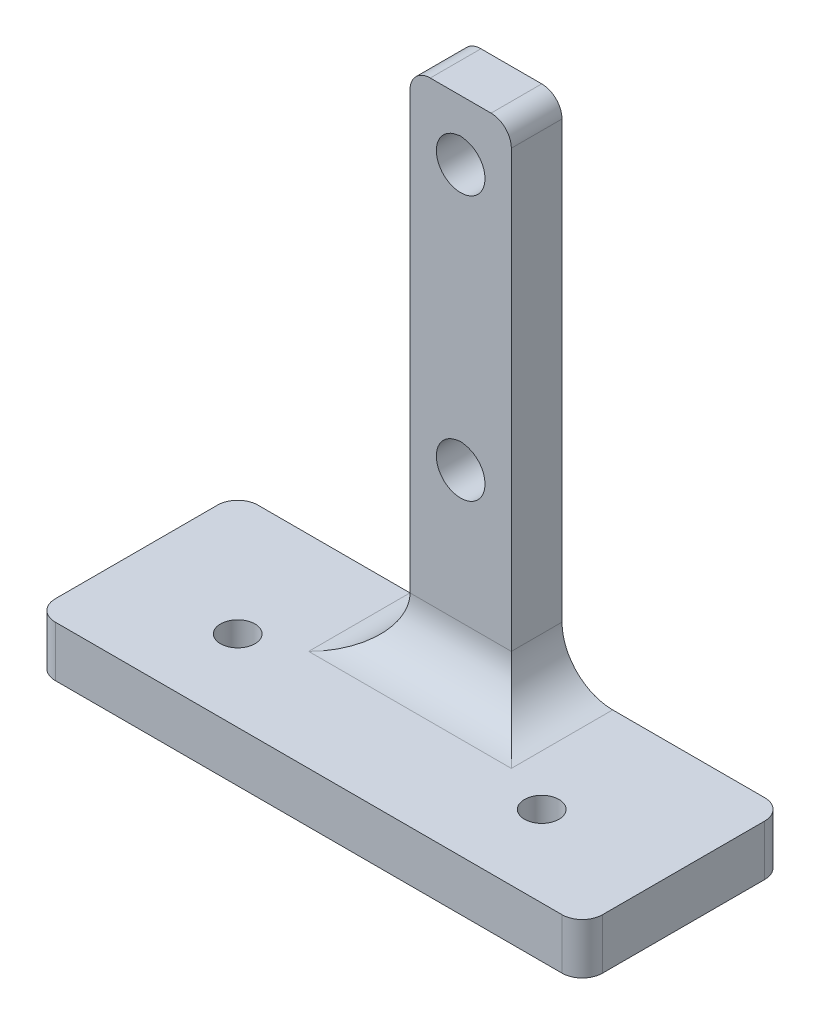
ISO-10303-21;
HEADER;
FILE_DESCRIPTION(('STEP AP214'),'2;1');
FILE_NAME('part.step','',(''),(''),'','','');
FILE_SCHEMA(('AUTOMOTIVE_DESIGN { 1 0 10303 214 1 1 1 1 }'));
ENDSEC;
DATA;
#1=APPLICATION_CONTEXT('core data for automotive mechanical design processes');
#2=APPLICATION_PROTOCOL_DEFINITION('international standard','automotive_design',2000,#1);
#3=PRODUCT_CONTEXT('',#1,'mechanical');
#4=PRODUCT('Part','Part','',(#3));
#5=PRODUCT_RELATED_PRODUCT_CATEGORY('part','',(#4));
#6=PRODUCT_DEFINITION_FORMATION('','',#4);
#7=PRODUCT_DEFINITION_CONTEXT('part definition',#1,'design');
#8=PRODUCT_DEFINITION('design','',#6,#7);
#9=PRODUCT_DEFINITION_SHAPE('','',#8);
#10=(LENGTH_UNIT() NAMED_UNIT(*) SI_UNIT(.MILLI.,.METRE.));
#11=(NAMED_UNIT(*) PLANE_ANGLE_UNIT() SI_UNIT($,.RADIAN.));
#12=(NAMED_UNIT(*) SI_UNIT($,.STERADIAN.) SOLID_ANGLE_UNIT());
#13=UNCERTAINTY_MEASURE_WITH_UNIT(LENGTH_MEASURE(1.E-05),#10,'distance_accuracy_value','');
#14=(GEOMETRIC_REPRESENTATION_CONTEXT(3) GLOBAL_UNCERTAINTY_ASSIGNED_CONTEXT((#13)) GLOBAL_UNIT_ASSIGNED_CONTEXT((#10,
#11,#12)) REPRESENTATION_CONTEXT('',''));
#15=CARTESIAN_POINT('',(0.,0.,0.));
#16=DIRECTION('',(0.,0.,1.));
#17=DIRECTION('',(1.,0.,0.));
#18=AXIS2_PLACEMENT_3D('',#15,#16,#17);
#19=CARTESIAN_POINT('',(-27.,5.,10.));
#20=DIRECTION('',(1.,0.,0.));
#21=DIRECTION('',(0.,0.,-1.));
#22=AXIS2_PLACEMENT_3D('',#19,#20,#21);
#23=PLANE('',#22);
#24=DIRECTION('',(0.,0.,1.));
#25=VECTOR('',#24,1.);
#26=CARTESIAN_POINT('',(-27.,5.,10.));
#27=LINE('',#26,#25);
#28=CARTESIAN_POINT('',(-27.,5.,-8.));
#29=VERTEX_POINT('',#28);
#30=CARTESIAN_POINT('',(-27.,5.,8.));
#31=VERTEX_POINT('',#30);
#32=EDGE_CURVE('E272',#29,#31,#27,.T.);
#33=ORIENTED_EDGE('',*,*,#32,.F.);
#34=DIRECTION('',(0.,-1.,0.));
#35=VECTOR('',#34,1.);
#36=CARTESIAN_POINT('',(-27.,5.,-8.));
#37=LINE('',#36,#35);
#38=CARTESIAN_POINT('',(-27.,0.,-8.));
#39=VERTEX_POINT('',#38);
#40=EDGE_CURVE('E389',#29,#39,#37,.T.);
#41=ORIENTED_EDGE('',*,*,#40,.T.);
#42=DIRECTION('',(0.,0.,1.));
#43=VECTOR('',#42,1.);
#44=CARTESIAN_POINT('',(-27.,0.,10.));
#45=LINE('',#44,#43);
#46=CARTESIAN_POINT('',(-27.,0.,8.));
#47=VERTEX_POINT('',#46);
#48=EDGE_CURVE('E271',#39,#47,#45,.T.);
#49=ORIENTED_EDGE('',*,*,#48,.T.);
#50=DIRECTION('',(0.,-1.,0.));
#51=VECTOR('',#50,1.);
#52=CARTESIAN_POINT('',(-27.,5.,8.));
#53=LINE('',#52,#51);
#54=EDGE_CURVE('E295',#47,#31,#53,.F.);
#55=ORIENTED_EDGE('',*,*,#54,.T.);
#56=EDGE_LOOP('',(#33,#41,#49,#55));
#57=FACE_BOUND('',#56,.T.);
#58=ADVANCED_FACE('F35',(#57),#23,.F.);
#59=CARTESIAN_POINT('',(27.,5.,10.));
#60=DIRECTION('',(0.,0.,-1.));
#61=DIRECTION('',(-1.,0.,0.));
#62=AXIS2_PLACEMENT_3D('',#59,#60,#61);
#63=PLANE('',#62);
#64=DIRECTION('',(1.,0.,0.));
#65=VECTOR('',#64,1.);
#66=CARTESIAN_POINT('',(27.,0.,10.));
#67=LINE('',#66,#65);
#68=CARTESIAN_POINT('',(-25.,0.,10.));
#69=VERTEX_POINT('',#68);
#70=CARTESIAN_POINT('',(25.,0.,10.));
#71=VERTEX_POINT('',#70);
#72=EDGE_CURVE('E411',#69,#71,#67,.T.);
#73=ORIENTED_EDGE('',*,*,#72,.T.);
#74=DIRECTION('',(0.,-1.,0.));
#75=VECTOR('',#74,1.);
#76=CARTESIAN_POINT('',(25.,5.,10.));
#77=LINE('',#76,#75);
#78=CARTESIAN_POINT('',(25.,5.,10.));
#79=VERTEX_POINT('',#78);
#80=EDGE_CURVE('E325',#71,#79,#77,.F.);
#81=ORIENTED_EDGE('',*,*,#80,.T.);
#82=DIRECTION('',(1.,0.,0.));
#83=VECTOR('',#82,1.);
#84=CARTESIAN_POINT('',(27.,5.,10.));
#85=LINE('',#84,#83);
#86=CARTESIAN_POINT('',(-25.,5.,10.));
#87=VERTEX_POINT('',#86);
#88=EDGE_CURVE('E275',#87,#79,#85,.T.);
#89=ORIENTED_EDGE('',*,*,#88,.F.);
#90=DIRECTION('',(0.,-1.,0.));
#91=VECTOR('',#90,1.);
#92=CARTESIAN_POINT('',(-25.,5.,10.));
#93=LINE('',#92,#91);
#94=EDGE_CURVE('E322',#87,#69,#93,.T.);
#95=ORIENTED_EDGE('',*,*,#94,.T.);
#96=EDGE_LOOP('',(#73,#81,#89,#95));
#97=FACE_BOUND('',#96,.T.);
#98=ADVANCED_FACE('F416',(#97),#63,.F.);
#99=CARTESIAN_POINT('',(27.,5.,10.));
#100=DIRECTION('',(-1.,0.,0.));
#101=DIRECTION('',(0.,0.,1.));
#102=AXIS2_PLACEMENT_3D('',#99,#100,#101);
#103=PLANE('',#102);
#104=DIRECTION('',(0.,0.,-1.));
#105=VECTOR('',#104,1.);
#106=CARTESIAN_POINT('',(27.,0.,10.));
#107=LINE('',#106,#105);
#108=CARTESIAN_POINT('',(27.,0.,8.));
#109=VERTEX_POINT('',#108);
#110=CARTESIAN_POINT('',(27.,0.,-8.00000000000001));
#111=VERTEX_POINT('',#110);
#112=EDGE_CURVE('E383',#109,#111,#107,.T.);
#113=ORIENTED_EDGE('',*,*,#112,.T.);
#114=DIRECTION('',(0.,-1.,0.));
#115=VECTOR('',#114,1.);
#116=CARTESIAN_POINT('',(27.,5.,-8.00000000000001));
#117=LINE('',#116,#115);
#118=CARTESIAN_POINT('',(27.,5.,-8.00000000000001));
#119=VERTEX_POINT('',#118);
#120=EDGE_CURVE('E320',#111,#119,#117,.F.);
#121=ORIENTED_EDGE('',*,*,#120,.T.);
#122=DIRECTION('',(0.,0.,-1.));
#123=VECTOR('',#122,1.);
#124=CARTESIAN_POINT('',(27.,5.,10.));
#125=LINE('',#124,#123);
#126=CARTESIAN_POINT('',(27.,5.,8.));
#127=VERTEX_POINT('',#126);
#128=EDGE_CURVE('E279',#127,#119,#125,.T.);
#129=ORIENTED_EDGE('',*,*,#128,.F.);
#130=DIRECTION('',(0.,-1.,0.));
#131=VECTOR('',#130,1.);
#132=CARTESIAN_POINT('',(27.,5.,8.));
#133=LINE('',#132,#131);
#134=EDGE_CURVE('E317',#127,#109,#133,.T.);
#135=ORIENTED_EDGE('',*,*,#134,.T.);
#136=EDGE_LOOP('',(#113,#121,#129,#135));
#137=FACE_BOUND('',#136,.T.);
#138=ADVANCED_FACE('F371',(#137),#103,.F.);
#139=CARTESIAN_POINT('',(27.,5.,-10.));
#140=DIRECTION('',(0.,0.,1.));
#141=DIRECTION('',(1.,0.,0.));
#142=AXIS2_PLACEMENT_3D('',#139,#140,#141);
#143=PLANE('',#142);
#144=CARTESIAN_POINT('',(0.,23.,-10.));
#145=DIRECTION('',(0.,0.,1.));
#146=DIRECTION('',(1.,0.,0.));
#147=AXIS2_PLACEMENT_3D('',#144,#145,#146);
#148=CIRCLE('',#147,2.4);
#149=CARTESIAN_POINT('',(-0.41675562640062,25.3635386072293,-10.));
#150=VERTEX_POINT('',#149);
#151=CARTESIAN_POINT('',(0.416755626400634,25.3635386072293,-10.));
#152=VERTEX_POINT('',#151);
#153=EDGE_CURVE('E196',#150,#152,#148,.T.);
#154=ORIENTED_EDGE('',*,*,#153,.T.);
#155=DIRECTION('',(-0.984807753012205,0.173648177666949,0.));
#156=VECTOR('',#155,1.);
#157=CARTESIAN_POINT('',(29.6807872969416,20.2035002594053,-10.));
#158=LINE('',#157,#156);
#159=CARTESIAN_POINT('',(0.,25.4370238685258,-10.));
#160=VERTEX_POINT('',#159);
#161=EDGE_CURVE('E220',#152,#160,#158,.T.);
#162=ORIENTED_EDGE('',*,*,#161,.T.);
#163=DIRECTION('',(-0.984807753012208,-0.17364817766693,0.));
#164=VECTOR('',#163,1.);
#165=CARTESIAN_POINT('',(22.6909134642781,29.438044129199,-10.));
#166=LINE('',#165,#164);
#167=EDGE_CURVE('E216',#160,#150,#166,.T.);
#168=ORIENTED_EDGE('',*,*,#167,.T.);
#169=EDGE_LOOP('',(#154,#162,#168));
#170=FACE_BOUND('',#169,.T.);
#171=DIRECTION('',(0.984807753012209,-0.173648177666923,0.));
#172=VECTOR('',#171,1.);
#173=CARTESIAN_POINT('',(34.1442925150605,45.5172962546951,-10.));
#174=LINE('',#173,#172);
#175=CARTESIAN_POINT('',(0.,51.5378562623021,-10.));
#176=VERTEX_POINT('',#175);
#177=CARTESIAN_POINT('',(0.416755626400632,51.4643710010056,-10.));
#178=VERTEX_POINT('',#177);
#179=EDGE_CURVE('E241',#176,#178,#174,.T.);
#180=ORIENTED_EDGE('',*,*,#179,.F.);
#181=DIRECTION('',(-0.984807753012211,-0.173648177666916,0.));
#182=VECTOR('',#181,1.);
#183=CARTESIAN_POINT('',(18.2274082461596,54.7518401244877,-10.));
#184=LINE('',#183,#182);
#185=CARTESIAN_POINT('',(-0.416755626400618,51.4643710010056,-10.));
#186=VERTEX_POINT('',#185);
#187=EDGE_CURVE('E244',#176,#186,#184,.T.);
#188=ORIENTED_EDGE('',*,*,#187,.T.);
#189=CARTESIAN_POINT('',(0.,49.1008323937763,-10.));
#190=DIRECTION('',(0.,0.,1.));
#191=DIRECTION('',(1.,0.,0.));
#192=AXIS2_PLACEMENT_3D('',#189,#190,#191);
#193=CIRCLE('',#192,2.4);
#194=EDGE_CURVE('E234',#186,#178,#193,.T.);
#195=ORIENTED_EDGE('',*,*,#194,.T.);
#196=EDGE_LOOP('',(#180,#188,#195));
#197=FACE_BOUND('',#196,.T.);
#198=DIRECTION('',(-1.,0.,0.));
#199=VECTOR('',#198,1.);
#200=CARTESIAN_POINT('',(27.,0.,-10.));
#201=LINE('',#200,#199);
#202=CARTESIAN_POINT('',(25.,0.,-10.));
#203=VERTEX_POINT('',#202);
#204=CARTESIAN_POINT('',(-25.,0.,-10.));
#205=VERTEX_POINT('',#204);
#206=EDGE_CURVE('E276',#203,#205,#201,.T.);
#207=ORIENTED_EDGE('',*,*,#206,.T.);
#208=DIRECTION('',(0.,-1.,0.));
#209=VECTOR('',#208,1.);
#210=CARTESIAN_POINT('',(-25.,5.,-10.));
#211=LINE('',#210,#209);
#212=CARTESIAN_POINT('',(-25.,5.,-10.));
#213=VERTEX_POINT('',#212);
#214=EDGE_CURVE('E306',#205,#213,#211,.F.);
#215=ORIENTED_EDGE('',*,*,#214,.T.);
#216=DIRECTION('',(-1.,0.,0.));
#217=VECTOR('',#216,1.);
#218=CARTESIAN_POINT('',(27.,5.,-10.));
#219=LINE('',#218,#217);
#220=CARTESIAN_POINT('',(-9.99999999999999,5.,-10.));
#221=VERTEX_POINT('',#220);
#222=EDGE_CURVE('E282',#221,#213,#219,.T.);
#223=ORIENTED_EDGE('',*,*,#222,.F.);
#224=CARTESIAN_POINT('',(-10.,10.,-10.));
#225=DIRECTION('',(0.,0.,1.));
#226=DIRECTION('',(1.,0.,0.));
#227=AXIS2_PLACEMENT_3D('',#224,#225,#226);
#228=CIRCLE('',#227,5.);
#229=CARTESIAN_POINT('',(-5.,10.,-10.));
#230=VERTEX_POINT('',#229);
#231=EDGE_CURVE('E44',#221,#230,#228,.T.);
#232=ORIENTED_EDGE('',*,*,#231,.T.);
#233=DIRECTION('',(0.,-1.,0.));
#234=VECTOR('',#233,1.);
#235=CARTESIAN_POINT('',(-5.,55.,-10.));
#236=LINE('',#235,#234);
#237=CARTESIAN_POINT('',(-5.,53.,-10.));
#238=VERTEX_POINT('',#237);
#239=EDGE_CURVE('E265',#238,#230,#236,.T.);
#240=ORIENTED_EDGE('',*,*,#239,.F.);
#241=CARTESIAN_POINT('',(-3.,53.,-10.));
#242=DIRECTION('',(0.,0.,1.));
#243=DIRECTION('',(1.,0.,0.));
#244=AXIS2_PLACEMENT_3D('',#241,#242,#243);
#245=CIRCLE('',#244,2.);
#246=CARTESIAN_POINT('',(-3.,55.,-10.));
#247=VERTEX_POINT('',#246);
#248=EDGE_CURVE('E298',#238,#247,#245,.F.);
#249=ORIENTED_EDGE('',*,*,#248,.T.);
#250=DIRECTION('',(-1.,0.,0.));
#251=VECTOR('',#250,1.);
#252=CARTESIAN_POINT('',(-5.,55.,-10.));
#253=LINE('',#252,#251);
#254=CARTESIAN_POINT('',(3.,55.,-10.));
#255=VERTEX_POINT('',#254);
#256=EDGE_CURVE('E262',#255,#247,#253,.T.);
#257=ORIENTED_EDGE('',*,*,#256,.F.);
#258=CARTESIAN_POINT('',(3.,53.,-10.));
#259=DIRECTION('',(0.,0.,1.));
#260=DIRECTION('',(1.,0.,0.));
#261=AXIS2_PLACEMENT_3D('',#258,#259,#260);
#262=CIRCLE('',#261,2.);
#263=CARTESIAN_POINT('',(5.,53.,-10.));
#264=VERTEX_POINT('',#263);
#265=EDGE_CURVE('E300',#255,#264,#262,.F.);
#266=ORIENTED_EDGE('',*,*,#265,.T.);
#267=DIRECTION('',(0.,-1.,0.));
#268=VECTOR('',#267,1.);
#269=CARTESIAN_POINT('',(5.,55.,-10.));
#270=LINE('',#269,#268);
#271=CARTESIAN_POINT('',(5.,10.,-10.));
#272=VERTEX_POINT('',#271);
#273=EDGE_CURVE('E269',#264,#272,#270,.T.);
#274=ORIENTED_EDGE('',*,*,#273,.T.);
#275=CARTESIAN_POINT('',(10.,10.,-10.));
#276=DIRECTION('',(0.,0.,1.));
#277=DIRECTION('',(1.,0.,0.));
#278=AXIS2_PLACEMENT_3D('',#275,#276,#277);
#279=CIRCLE('',#278,5.);
#280=CARTESIAN_POINT('',(10.,5.,-10.));
#281=VERTEX_POINT('',#280);
#282=EDGE_CURVE('E11',#272,#281,#279,.T.);
#283=ORIENTED_EDGE('',*,*,#282,.T.);
#284=CARTESIAN_POINT('',(25.,5.,-10.));
#285=VERTEX_POINT('',#284);
#286=EDGE_CURVE('E291',#285,#281,#219,.T.);
#287=ORIENTED_EDGE('',*,*,#286,.F.);
#288=DIRECTION('',(0.,-1.,0.));
#289=VECTOR('',#288,1.);
#290=CARTESIAN_POINT('',(25.,5.,-10.));
#291=LINE('',#290,#289);
#292=EDGE_CURVE('E303',#285,#203,#291,.T.);
#293=ORIENTED_EDGE('',*,*,#292,.T.);
#294=EDGE_LOOP('',(#207,#215,#223,#232,#240,#249,#257,#266,#274,#283,#287,#293));
#295=FACE_BOUND('',#294,.T.);
#296=ADVANCED_FACE('F367',(#170,#197,#295),#143,.F.);
#297=CARTESIAN_POINT('',(0.,5.,0.));
#298=DIRECTION('',(0.,1.,0.));
#299=DIRECTION('',(0.,0.,1.));
#300=AXIS2_PLACEMENT_3D('',#297,#298,#299);
#301=PLANE('',#300);
#302=CARTESIAN_POINT('',(15.,5.,2.));
#303=DIRECTION('',(0.,1.,0.));
#304=DIRECTION('',(0.,0.,1.));
#305=AXIS2_PLACEMENT_3D('',#302,#303,#304);
#306=CIRCLE('',#305,1.69999999999999);
#307=CARTESIAN_POINT('',(15.,5.,3.69999999999999));
#308=VERTEX_POINT('',#307);
#309=EDGE_CURVE('E247',#308,#308,#306,.T.);
#310=ORIENTED_EDGE('',*,*,#309,.F.);
#311=EDGE_LOOP('',(#310));
#312=FACE_BOUND('',#311,.T.);
#313=CARTESIAN_POINT('',(-15.,5.,2.));
#314=DIRECTION('',(0.,1.,0.));
#315=DIRECTION('',(0.,0.,1.));
#316=AXIS2_PLACEMENT_3D('',#313,#314,#315);
#317=CIRCLE('',#316,1.69999999999999);
#318=CARTESIAN_POINT('',(-15.,5.,3.69999999999999));
#319=VERTEX_POINT('',#318);
#320=EDGE_CURVE('E253',#319,#319,#317,.T.);
#321=ORIENTED_EDGE('',*,*,#320,.F.);
#322=EDGE_LOOP('',(#321));
#323=FACE_BOUND('',#322,.T.);
#324=DIRECTION('',(1.,0.,0.));
#325=VECTOR('',#324,1.);
#326=CARTESIAN_POINT('',(0.,5.,0.));
#327=LINE('',#326,#325);
#328=CARTESIAN_POINT('',(10.,5.,0.));
#329=VERTEX_POINT('',#328);
#330=CARTESIAN_POINT('',(-10.,5.,0.));
#331=VERTEX_POINT('',#330);
#332=EDGE_CURVE('E347',#329,#331,#327,.F.);
#333=ORIENTED_EDGE('',*,*,#332,.T.);
#334=DIRECTION('',(0.,0.,1.));
#335=VECTOR('',#334,1.);
#336=CARTESIAN_POINT('',(-10.,5.,0.));
#337=LINE('',#336,#335);
#338=EDGE_CURVE('E351',#331,#221,#337,.F.);
#339=ORIENTED_EDGE('',*,*,#338,.T.);
#340=ORIENTED_EDGE('',*,*,#222,.T.);
#341=CARTESIAN_POINT('',(-25.,5.,-8.));
#342=DIRECTION('',(0.,1.,0.));
#343=DIRECTION('',(0.,0.,1.));
#344=AXIS2_PLACEMENT_3D('',#341,#342,#343);
#345=CIRCLE('',#344,2.);
#346=EDGE_CURVE('E315',#213,#29,#345,.T.);
#347=ORIENTED_EDGE('',*,*,#346,.T.);
#348=ORIENTED_EDGE('',*,*,#32,.T.);
#349=CARTESIAN_POINT('',(-25.,5.,8.));
#350=DIRECTION('',(0.,1.,0.));
#351=DIRECTION('',(0.,0.,1.));
#352=AXIS2_PLACEMENT_3D('',#349,#350,#351);
#353=CIRCLE('',#352,2.);
#354=EDGE_CURVE('E309',#31,#87,#353,.T.);
#355=ORIENTED_EDGE('',*,*,#354,.T.);
#356=ORIENTED_EDGE('',*,*,#88,.T.);
#357=CARTESIAN_POINT('',(25.,5.,8.));
#358=DIRECTION('',(0.,1.,0.));
#359=DIRECTION('',(0.,0.,1.));
#360=AXIS2_PLACEMENT_3D('',#357,#358,#359);
#361=CIRCLE('',#360,2.);
#362=EDGE_CURVE('E311',#79,#127,#361,.T.);
#363=ORIENTED_EDGE('',*,*,#362,.T.);
#364=ORIENTED_EDGE('',*,*,#128,.T.);
#365=CARTESIAN_POINT('',(25.,5.,-8.));
#366=DIRECTION('',(0.,1.,0.));
#367=DIRECTION('',(0.,0.,1.));
#368=AXIS2_PLACEMENT_3D('',#365,#366,#367);
#369=CIRCLE('',#368,2.);
#370=EDGE_CURVE('E313',#119,#285,#369,.T.);
#371=ORIENTED_EDGE('',*,*,#370,.T.);
#372=ORIENTED_EDGE('',*,*,#286,.T.);
#373=DIRECTION('',(0.,0.,-1.));
#374=VECTOR('',#373,1.);
#375=CARTESIAN_POINT('',(10.,5.,0.));
#376=LINE('',#375,#374);
#377=EDGE_CURVE('E342',#281,#329,#376,.F.);
#378=ORIENTED_EDGE('',*,*,#377,.T.);
#379=EDGE_LOOP('',(#333,#339,#340,#347,#348,#355,#356,#363,#364,#371,#372,#378));
#380=FACE_BOUND('',#379,.T.);
#381=ADVANCED_FACE('F370',(#312,#323,#380),#301,.T.);
#382=CARTESIAN_POINT('',(0.,0.,0.));
#383=DIRECTION('',(0.,1.,0.));
#384=DIRECTION('',(0.,0.,1.));
#385=AXIS2_PLACEMENT_3D('',#382,#383,#384);
#386=PLANE('',#385);
#387=CARTESIAN_POINT('',(15.,0.,2.));
#388=DIRECTION('',(0.,1.,0.));
#389=DIRECTION('',(0.,0.,1.));
#390=AXIS2_PLACEMENT_3D('',#387,#388,#389);
#391=CIRCLE('',#390,1.7);
#392=CARTESIAN_POINT('',(15.,0.,3.7));
#393=VERTEX_POINT('',#392);
#394=EDGE_CURVE('E250',#393,#393,#391,.T.);
#395=ORIENTED_EDGE('',*,*,#394,.T.);
#396=EDGE_LOOP('',(#395));
#397=FACE_BOUND('',#396,.T.);
#398=CARTESIAN_POINT('',(-15.,0.,2.));
#399=DIRECTION('',(0.,1.,0.));
#400=DIRECTION('',(0.,0.,1.));
#401=AXIS2_PLACEMENT_3D('',#398,#399,#400);
#402=CIRCLE('',#401,1.7);
#403=CARTESIAN_POINT('',(-15.,0.,3.7));
#404=VERTEX_POINT('',#403);
#405=EDGE_CURVE('E256',#404,#404,#402,.T.);
#406=ORIENTED_EDGE('',*,*,#405,.T.);
#407=EDGE_LOOP('',(#406));
#408=FACE_BOUND('',#407,.T.);
#409=ORIENTED_EDGE('',*,*,#48,.F.);
#410=CARTESIAN_POINT('',(-25.,0.,-8.));
#411=DIRECTION('',(0.,1.,0.));
#412=DIRECTION('',(0.,0.,1.));
#413=AXIS2_PLACEMENT_3D('',#410,#411,#412);
#414=CIRCLE('',#413,2.);
#415=EDGE_CURVE('E301',#39,#205,#414,.F.);
#416=ORIENTED_EDGE('',*,*,#415,.T.);
#417=ORIENTED_EDGE('',*,*,#206,.F.);
#418=CARTESIAN_POINT('',(25.,0.,-8.));
#419=DIRECTION('',(0.,1.,0.));
#420=DIRECTION('',(0.,0.,1.));
#421=AXIS2_PLACEMENT_3D('',#418,#419,#420);
#422=CIRCLE('',#421,2.);
#423=EDGE_CURVE('E406',#203,#111,#422,.F.);
#424=ORIENTED_EDGE('',*,*,#423,.T.);
#425=ORIENTED_EDGE('',*,*,#112,.F.);
#426=CARTESIAN_POINT('',(25.,0.,8.));
#427=DIRECTION('',(0.,1.,0.));
#428=DIRECTION('',(0.,0.,1.));
#429=AXIS2_PLACEMENT_3D('',#426,#427,#428);
#430=CIRCLE('',#429,2.);
#431=EDGE_CURVE('E404',#109,#71,#430,.F.);
#432=ORIENTED_EDGE('',*,*,#431,.T.);
#433=ORIENTED_EDGE('',*,*,#72,.F.);
#434=CARTESIAN_POINT('',(-25.,0.,8.));
#435=DIRECTION('',(0.,1.,0.));
#436=DIRECTION('',(0.,0.,1.));
#437=AXIS2_PLACEMENT_3D('',#434,#435,#436);
#438=CIRCLE('',#437,2.);
#439=EDGE_CURVE('E398',#69,#47,#438,.F.);
#440=ORIENTED_EDGE('',*,*,#439,.T.);
#441=EDGE_LOOP('',(#409,#416,#417,#424,#425,#432,#433,#440));
#442=FACE_BOUND('',#441,.T.);
#443=ADVANCED_FACE('F459',(#397,#408,#442),#386,.F.);
#444=CARTESIAN_POINT('',(-5.,55.,-10.));
#445=DIRECTION('',(1.,0.,0.));
#446=DIRECTION('',(0.,0.,-1.));
#447=AXIS2_PLACEMENT_3D('',#444,#445,#446);
#448=PLANE('',#447);
#449=ORIENTED_EDGE('',*,*,#239,.T.);
#450=DIRECTION('',(0.,0.,1.));
#451=VECTOR('',#450,1.);
#452=CARTESIAN_POINT('',(-5.,10.,-10.));
#453=LINE('',#452,#451);
#454=CARTESIAN_POINT('',(-5.,10.,-5.));
#455=VERTEX_POINT('',#454);
#456=EDGE_CURVE('E340',#230,#455,#453,.T.);
#457=ORIENTED_EDGE('',*,*,#456,.T.);
#458=DIRECTION('',(0.,-1.,0.));
#459=VECTOR('',#458,1.);
#460=CARTESIAN_POINT('',(-5.,55.,-5.));
#461=LINE('',#460,#459);
#462=CARTESIAN_POINT('',(-5.,53.,-5.));
#463=VERTEX_POINT('',#462);
#464=EDGE_CURVE('E268',#463,#455,#461,.T.);
#465=ORIENTED_EDGE('',*,*,#464,.F.);
#466=DIRECTION('',(0.,0.,1.));
#467=VECTOR('',#466,1.);
#468=CARTESIAN_POINT('',(-5.,53.,-10.));
#469=LINE('',#468,#467);
#470=EDGE_CURVE('E339',#463,#238,#469,.F.);
#471=ORIENTED_EDGE('',*,*,#470,.T.);
#472=EDGE_LOOP('',(#449,#457,#465,#471));
#473=FACE_BOUND('',#472,.T.);
#474=ADVANCED_FACE('F437',(#473),#448,.F.);
#475=CARTESIAN_POINT('',(-5.,55.,-5.));
#476=DIRECTION('',(0.,0.,-1.));
#477=DIRECTION('',(-1.,0.,0.));
#478=AXIS2_PLACEMENT_3D('',#475,#476,#477);
#479=PLANE('',#478);
#480=DIRECTION('',(-0.984807753012208,-0.17364817766693,0.));
#481=VECTOR('',#480,1.);
#482=CARTESIAN_POINT('',(0.,25.4370238685258,-5.));
#483=LINE('',#482,#481);
#484=CARTESIAN_POINT('',(0.,25.4370238685258,-5.));
#485=VERTEX_POINT('',#484);
#486=CARTESIAN_POINT('',(-0.416755626400618,25.3635386072293,-5.));
#487=VERTEX_POINT('',#486);
#488=EDGE_CURVE('E204',#485,#487,#483,.T.);
#489=ORIENTED_EDGE('',*,*,#488,.F.);
#490=DIRECTION('',(-0.984807753012205,0.173648177666949,0.));
#491=VECTOR('',#490,1.);
#492=CARTESIAN_POINT('',(0.,25.4370238685258,-5.));
#493=LINE('',#492,#491);
#494=CARTESIAN_POINT('',(0.416755626400634,25.3635386072293,-5.));
#495=VERTEX_POINT('',#494);
#496=EDGE_CURVE('E208',#495,#485,#493,.T.);
#497=ORIENTED_EDGE('',*,*,#496,.F.);
#498=CARTESIAN_POINT('',(0.,23.,-5.));
#499=DIRECTION('',(0.,0.,1.));
#500=DIRECTION('',(1.,0.,0.));
#501=AXIS2_PLACEMENT_3D('',#498,#499,#500);
#502=CIRCLE('',#501,2.4);
#503=EDGE_CURVE('E193',#487,#495,#502,.T.);
#504=ORIENTED_EDGE('',*,*,#503,.F.);
#505=EDGE_LOOP('',(#489,#497,#504));
#506=FACE_BOUND('',#505,.T.);
#507=CARTESIAN_POINT('',(0.,49.1008323937763,-5.));
#508=DIRECTION('',(0.,0.,1.));
#509=DIRECTION('',(1.,0.,0.));
#510=AXIS2_PLACEMENT_3D('',#507,#508,#509);
#511=CIRCLE('',#510,2.4);
#512=CARTESIAN_POINT('',(-0.416755626400618,51.4643710010056,-5.));
#513=VERTEX_POINT('',#512);
#514=CARTESIAN_POINT('',(0.416755626400632,51.4643710010056,-5.));
#515=VERTEX_POINT('',#514);
#516=EDGE_CURVE('E225',#513,#515,#511,.T.);
#517=ORIENTED_EDGE('',*,*,#516,.F.);
#518=DIRECTION('',(-0.98480775301221,-0.173648177666916,0.));
#519=VECTOR('',#518,1.);
#520=CARTESIAN_POINT('',(0.,51.5378562623021,-5.));
#521=LINE('',#520,#519);
#522=CARTESIAN_POINT('',(0.,51.5378562623021,-5.));
#523=VERTEX_POINT('',#522);
#524=EDGE_CURVE('E223',#523,#513,#521,.T.);
#525=ORIENTED_EDGE('',*,*,#524,.F.);
#526=DIRECTION('',(0.984807753012209,-0.173648177666923,0.));
#527=VECTOR('',#526,1.);
#528=CARTESIAN_POINT('',(0.,51.5378562623021,-5.));
#529=LINE('',#528,#527);
#530=EDGE_CURVE('E228',#523,#515,#529,.T.);
#531=ORIENTED_EDGE('',*,*,#530,.T.);
#532=EDGE_LOOP('',(#517,#525,#531));
#533=FACE_BOUND('',#532,.T.);
#534=ORIENTED_EDGE('',*,*,#464,.T.);
#535=DIRECTION('',(1.,0.,0.));
#536=VECTOR('',#535,1.);
#537=CARTESIAN_POINT('',(-5.,10.,-5.));
#538=LINE('',#537,#536);
#539=CARTESIAN_POINT('',(5.,10.,-5.));
#540=VERTEX_POINT('',#539);
#541=EDGE_CURVE('E60',#455,#540,#538,.T.);
#542=ORIENTED_EDGE('',*,*,#541,.T.);
#543=DIRECTION('',(0.,-1.,0.));
#544=VECTOR('',#543,1.);
#545=CARTESIAN_POINT('',(5.,55.,-5.));
#546=LINE('',#545,#544);
#547=CARTESIAN_POINT('',(5.,53.,-5.));
#548=VERTEX_POINT('',#547);
#549=EDGE_CURVE('E266',#548,#540,#546,.T.);
#550=ORIENTED_EDGE('',*,*,#549,.F.);
#551=CARTESIAN_POINT('',(3.,53.,-5.));
#552=DIRECTION('',(0.,0.,-1.));
#553=DIRECTION('',(-1.,0.,0.));
#554=AXIS2_PLACEMENT_3D('',#551,#552,#553);
#555=CIRCLE('',#554,2.);
#556=CARTESIAN_POINT('',(3.,55.,-5.));
#557=VERTEX_POINT('',#556);
#558=EDGE_CURVE('E337',#548,#557,#555,.F.);
#559=ORIENTED_EDGE('',*,*,#558,.T.);
#560=DIRECTION('',(1.,0.,0.));
#561=VECTOR('',#560,1.);
#562=CARTESIAN_POINT('',(-5.,55.,-5.));
#563=LINE('',#562,#561);
#564=CARTESIAN_POINT('',(-3.,55.,-5.));
#565=VERTEX_POINT('',#564);
#566=EDGE_CURVE('E259',#565,#557,#563,.T.);
#567=ORIENTED_EDGE('',*,*,#566,.F.);
#568=CARTESIAN_POINT('',(-3.,53.,-5.));
#569=DIRECTION('',(0.,0.,-1.));
#570=DIRECTION('',(-1.,0.,0.));
#571=AXIS2_PLACEMENT_3D('',#568,#569,#570);
#572=CIRCLE('',#571,2.);
#573=EDGE_CURVE('E335',#565,#463,#572,.F.);
#574=ORIENTED_EDGE('',*,*,#573,.T.);
#575=EDGE_LOOP('',(#534,#542,#550,#559,#567,#574));
#576=FACE_BOUND('',#575,.T.);
#577=ADVANCED_FACE('F210',(#506,#533,#576),#479,.F.);
#578=CARTESIAN_POINT('',(5.,55.,-10.));
#579=DIRECTION('',(-1.,0.,0.));
#580=DIRECTION('',(0.,0.,1.));
#581=AXIS2_PLACEMENT_3D('',#578,#579,#580);
#582=PLANE('',#581);
#583=ORIENTED_EDGE('',*,*,#549,.T.);
#584=DIRECTION('',(0.,0.,-1.));
#585=VECTOR('',#584,1.);
#586=CARTESIAN_POINT('',(5.,10.,-10.));
#587=LINE('',#586,#585);
#588=EDGE_CURVE('E52',#540,#272,#587,.T.);
#589=ORIENTED_EDGE('',*,*,#588,.T.);
#590=ORIENTED_EDGE('',*,*,#273,.F.);
#591=DIRECTION('',(0.,0.,-1.));
#592=VECTOR('',#591,1.);
#593=CARTESIAN_POINT('',(5.,53.,-5.));
#594=LINE('',#593,#592);
#595=EDGE_CURVE('E333',#264,#548,#594,.F.);
#596=ORIENTED_EDGE('',*,*,#595,.T.);
#597=EDGE_LOOP('',(#583,#589,#590,#596));
#598=FACE_BOUND('',#597,.T.);
#599=ADVANCED_FACE('F451',(#598),#582,.F.);
#600=CARTESIAN_POINT('',(0.,55.,0.));
#601=DIRECTION('',(0.,1.,0.));
#602=DIRECTION('',(0.,0.,1.));
#603=AXIS2_PLACEMENT_3D('',#600,#601,#602);
#604=PLANE('',#603);
#605=ORIENTED_EDGE('',*,*,#566,.T.);
#606=DIRECTION('',(0.,0.,-1.));
#607=VECTOR('',#606,1.);
#608=CARTESIAN_POINT('',(3.,55.,-10.));
#609=LINE('',#608,#607);
#610=EDGE_CURVE('E330',#557,#255,#609,.T.);
#611=ORIENTED_EDGE('',*,*,#610,.T.);
#612=ORIENTED_EDGE('',*,*,#256,.T.);
#613=DIRECTION('',(0.,0.,1.));
#614=VECTOR('',#613,1.);
#615=CARTESIAN_POINT('',(-3.,55.,-5.));
#616=LINE('',#615,#614);
#617=EDGE_CURVE('E327',#247,#565,#616,.T.);
#618=ORIENTED_EDGE('',*,*,#617,.T.);
#619=EDGE_LOOP('',(#605,#611,#612,#618));
#620=FACE_BOUND('',#619,.T.);
#621=ADVANCED_FACE('F444',(#620),#604,.T.);
#622=CARTESIAN_POINT('',(-15.,5.,2.));
#623=DIRECTION('',(0.,1.,0.));
#624=DIRECTION('',(0.,0.,1.));
#625=AXIS2_PLACEMENT_3D('',#622,#623,#624);
#626=CYLINDRICAL_SURFACE('',#625,1.69999999999999);
#627=ORIENTED_EDGE('',*,*,#405,.F.);
#628=EDGE_LOOP('',(#627));
#629=FACE_BOUND('',#628,.T.);
#630=ORIENTED_EDGE('',*,*,#320,.T.);
#631=EDGE_LOOP('',(#630));
#632=FACE_BOUND('',#631,.T.);
#633=ADVANCED_FACE('F513',(#629,#632),#626,.F.);
#634=CARTESIAN_POINT('',(15.,5.,2.));
#635=DIRECTION('',(0.,1.,0.));
#636=DIRECTION('',(0.,0.,1.));
#637=AXIS2_PLACEMENT_3D('',#634,#635,#636);
#638=CYLINDRICAL_SURFACE('',#637,1.69999999999999);
#639=ORIENTED_EDGE('',*,*,#394,.F.);
#640=EDGE_LOOP('',(#639));
#641=FACE_BOUND('',#640,.T.);
#642=ORIENTED_EDGE('',*,*,#309,.T.);
#643=EDGE_LOOP('',(#642));
#644=FACE_BOUND('',#643,.T.);
#645=ADVANCED_FACE('F471',(#641,#644),#638,.F.);
#646=CARTESIAN_POINT('',(-25.,5.,-8.));
#647=DIRECTION('',(0.,-1.,0.));
#648=DIRECTION('',(0.,0.,-1.));
#649=AXIS2_PLACEMENT_3D('',#646,#647,#648);
#650=CYLINDRICAL_SURFACE('',#649,2.);
#651=ORIENTED_EDGE('',*,*,#346,.F.);
#652=ORIENTED_EDGE('',*,*,#214,.F.);
#653=ORIENTED_EDGE('',*,*,#415,.F.);
#654=ORIENTED_EDGE('',*,*,#40,.F.);
#655=EDGE_LOOP('',(#651,#652,#653,#654));
#656=FACE_BOUND('',#655,.T.);
#657=ADVANCED_FACE('F386',(#656),#650,.T.);
#658=CARTESIAN_POINT('',(25.,5.,-8.));
#659=DIRECTION('',(0.,-1.,0.));
#660=DIRECTION('',(0.,0.,-1.));
#661=AXIS2_PLACEMENT_3D('',#658,#659,#660);
#662=CYLINDRICAL_SURFACE('',#661,2.);
#663=ORIENTED_EDGE('',*,*,#370,.F.);
#664=ORIENTED_EDGE('',*,*,#120,.F.);
#665=ORIENTED_EDGE('',*,*,#423,.F.);
#666=ORIENTED_EDGE('',*,*,#292,.F.);
#667=EDGE_LOOP('',(#663,#664,#665,#666));
#668=FACE_BOUND('',#667,.T.);
#669=ADVANCED_FACE('F429',(#668),#662,.T.);
#670=CARTESIAN_POINT('',(25.,5.,8.));
#671=DIRECTION('',(0.,-1.,0.));
#672=DIRECTION('',(0.,0.,-1.));
#673=AXIS2_PLACEMENT_3D('',#670,#671,#672);
#674=CYLINDRICAL_SURFACE('',#673,2.);
#675=ORIENTED_EDGE('',*,*,#362,.F.);
#676=ORIENTED_EDGE('',*,*,#80,.F.);
#677=ORIENTED_EDGE('',*,*,#431,.F.);
#678=ORIENTED_EDGE('',*,*,#134,.F.);
#679=EDGE_LOOP('',(#675,#676,#677,#678));
#680=FACE_BOUND('',#679,.T.);
#681=ADVANCED_FACE('F421',(#680),#674,.T.);
#682=CARTESIAN_POINT('',(-25.,5.,8.));
#683=DIRECTION('',(0.,-1.,0.));
#684=DIRECTION('',(0.,0.,-1.));
#685=AXIS2_PLACEMENT_3D('',#682,#683,#684);
#686=CYLINDRICAL_SURFACE('',#685,2.);
#687=ORIENTED_EDGE('',*,*,#354,.F.);
#688=ORIENTED_EDGE('',*,*,#54,.F.);
#689=ORIENTED_EDGE('',*,*,#439,.F.);
#690=ORIENTED_EDGE('',*,*,#94,.F.);
#691=EDGE_LOOP('',(#687,#688,#689,#690));
#692=FACE_BOUND('',#691,.T.);
#693=ADVANCED_FACE('F476',(#692),#686,.T.);
#694=CARTESIAN_POINT('',(3.,53.,0.));
#695=DIRECTION('',(0.,0.,1.));
#696=DIRECTION('',(1.,0.,0.));
#697=AXIS2_PLACEMENT_3D('',#694,#695,#696);
#698=CYLINDRICAL_SURFACE('',#697,2.);
#699=ORIENTED_EDGE('',*,*,#558,.F.);
#700=ORIENTED_EDGE('',*,*,#595,.F.);
#701=ORIENTED_EDGE('',*,*,#265,.F.);
#702=ORIENTED_EDGE('',*,*,#610,.F.);
#703=EDGE_LOOP('',(#699,#700,#701,#702));
#704=FACE_BOUND('',#703,.T.);
#705=ADVANCED_FACE('F449',(#704),#698,.T.);
#706=CARTESIAN_POINT('',(-3.,53.,0.));
#707=DIRECTION('',(0.,0.,-1.));
#708=DIRECTION('',(-1.,0.,0.));
#709=AXIS2_PLACEMENT_3D('',#706,#707,#708);
#710=CYLINDRICAL_SURFACE('',#709,2.);
#711=ORIENTED_EDGE('',*,*,#248,.F.);
#712=ORIENTED_EDGE('',*,*,#470,.F.);
#713=ORIENTED_EDGE('',*,*,#573,.F.);
#714=ORIENTED_EDGE('',*,*,#617,.F.);
#715=EDGE_LOOP('',(#711,#712,#713,#714));
#716=FACE_BOUND('',#715,.T.);
#717=ADVANCED_FACE('F440',(#716),#710,.T.);
#718=CARTESIAN_POINT('',(0.,51.5378562623021,-18.));
#719=DIRECTION('',(-0.173648177666916,0.984807753012211,0.));
#720=DIRECTION('',(-0.984807753012211,-0.173648177666916,0.));
#721=AXIS2_PLACEMENT_3D('',#718,#719,#720);
#722=PLANE('',#721);
#723=DIRECTION('',(0.,0.,1.));
#724=VECTOR('',#723,1.);
#725=CARTESIAN_POINT('',(0.,51.5378562623021,-18.));
#726=LINE('',#725,#724);
#727=EDGE_CURVE('E232',#176,#523,#726,.T.);
#728=ORIENTED_EDGE('',*,*,#727,.T.);
#729=ORIENTED_EDGE('',*,*,#524,.T.);
#730=DIRECTION('',(0.,0.,1.));
#731=VECTOR('',#730,1.);
#732=CARTESIAN_POINT('',(-0.416755626400618,51.4643710010056,-18.));
#733=LINE('',#732,#731);
#734=EDGE_CURVE('E231',#186,#513,#733,.T.);
#735=ORIENTED_EDGE('',*,*,#734,.F.);
#736=ORIENTED_EDGE('',*,*,#187,.F.);
#737=EDGE_LOOP('',(#728,#729,#735,#736));
#738=FACE_BOUND('',#737,.T.);
#739=ADVANCED_FACE('F483',(#738),#722,.F.);
#740=CARTESIAN_POINT('',(0.,51.5378562623021,-18.));
#741=DIRECTION('',(-0.173648177666923,-0.984807753012209,0.));
#742=DIRECTION('',(0.984807753012209,-0.173648177666923,0.));
#743=AXIS2_PLACEMENT_3D('',#740,#741,#742);
#744=PLANE('',#743);
#745=ORIENTED_EDGE('',*,*,#179,.T.);
#746=DIRECTION('',(0.,0.,1.));
#747=VECTOR('',#746,1.);
#748=CARTESIAN_POINT('',(0.416755626400632,51.4643710010056,-18.));
#749=LINE('',#748,#747);
#750=EDGE_CURVE('E235',#178,#515,#749,.T.);
#751=ORIENTED_EDGE('',*,*,#750,.T.);
#752=ORIENTED_EDGE('',*,*,#530,.F.);
#753=ORIENTED_EDGE('',*,*,#727,.F.);
#754=EDGE_LOOP('',(#745,#751,#752,#753));
#755=FACE_BOUND('',#754,.T.);
#756=ADVANCED_FACE('F501',(#755),#744,.T.);
#757=CARTESIAN_POINT('',(0.,49.1008323937763,-18.));
#758=DIRECTION('',(0.,0.,1.));
#759=DIRECTION('',(1.,0.,0.));
#760=AXIS2_PLACEMENT_3D('',#757,#758,#759);
#761=CYLINDRICAL_SURFACE('',#760,2.4);
#762=ORIENTED_EDGE('',*,*,#734,.T.);
#763=ORIENTED_EDGE('',*,*,#516,.T.);
#764=ORIENTED_EDGE('',*,*,#750,.F.);
#765=ORIENTED_EDGE('',*,*,#194,.F.);
#766=EDGE_LOOP('',(#762,#763,#764,#765));
#767=FACE_BOUND('',#766,.T.);
#768=ADVANCED_FACE('F500',(#767),#761,.F.);
#769=CARTESIAN_POINT('',(0.,25.4370238685258,-18.));
#770=DIRECTION('',(0.173648177666949,0.984807753012205,0.));
#771=DIRECTION('',(-0.984807753012205,0.173648177666949,0.));
#772=AXIS2_PLACEMENT_3D('',#769,#770,#771);
#773=PLANE('',#772);
#774=DIRECTION('',(0.,0.,1.));
#775=VECTOR('',#774,1.);
#776=CARTESIAN_POINT('',(0.416755626400634,25.3635386072293,-18.));
#777=LINE('',#776,#775);
#778=EDGE_CURVE('E199',#152,#495,#777,.T.);
#779=ORIENTED_EDGE('',*,*,#778,.T.);
#780=ORIENTED_EDGE('',*,*,#496,.T.);
#781=DIRECTION('',(0.,0.,1.));
#782=VECTOR('',#781,1.);
#783=CARTESIAN_POINT('',(0.,25.4370238685258,-18.));
#784=LINE('',#783,#782);
#785=EDGE_CURVE('E200',#160,#485,#784,.T.);
#786=ORIENTED_EDGE('',*,*,#785,.F.);
#787=ORIENTED_EDGE('',*,*,#161,.F.);
#788=EDGE_LOOP('',(#779,#780,#786,#787));
#789=FACE_BOUND('',#788,.T.);
#790=ADVANCED_FACE('F365',(#789),#773,.F.);
#791=CARTESIAN_POINT('',(0.,23.,-18.));
#792=DIRECTION('',(0.,0.,1.));
#793=DIRECTION('',(1.,0.,0.));
#794=AXIS2_PLACEMENT_3D('',#791,#792,#793);
#795=CYLINDRICAL_SURFACE('',#794,2.4);
#796=DIRECTION('',(0.,0.,1.));
#797=VECTOR('',#796,1.);
#798=CARTESIAN_POINT('',(-0.416755626400618,25.3635386072293,-18.));
#799=LINE('',#798,#797);
#800=EDGE_CURVE('E188',#150,#487,#799,.T.);
#801=ORIENTED_EDGE('',*,*,#800,.T.);
#802=ORIENTED_EDGE('',*,*,#503,.T.);
#803=ORIENTED_EDGE('',*,*,#778,.F.);
#804=ORIENTED_EDGE('',*,*,#153,.F.);
#805=EDGE_LOOP('',(#801,#802,#803,#804));
#806=FACE_BOUND('',#805,.T.);
#807=ADVANCED_FACE('F190',(#806),#795,.F.);
#808=CARTESIAN_POINT('',(0.,25.4370238685258,-18.));
#809=DIRECTION('',(-0.17364817766693,0.984807753012208,0.));
#810=DIRECTION('',(-0.984807753012208,-0.17364817766693,0.));
#811=AXIS2_PLACEMENT_3D('',#808,#809,#810);
#812=PLANE('',#811);
#813=ORIENTED_EDGE('',*,*,#785,.T.);
#814=ORIENTED_EDGE('',*,*,#488,.T.);
#815=ORIENTED_EDGE('',*,*,#800,.F.);
#816=ORIENTED_EDGE('',*,*,#167,.F.);
#817=EDGE_LOOP('',(#813,#814,#815,#816));
#818=FACE_BOUND('',#817,.T.);
#819=ADVANCED_FACE('F205',(#818),#812,.F.);
#820=CARTESIAN_POINT('',(10.,10.,-10.));
#821=DIRECTION('',(0.,0.,-1.));
#822=DIRECTION('',(-1.,0.,0.));
#823=AXIS2_PLACEMENT_3D('',#820,#821,#822);
#824=CYLINDRICAL_SURFACE('',#823,5.);
#825=ORIENTED_EDGE('',*,*,#282,.F.);
#826=ORIENTED_EDGE('',*,*,#588,.F.);
#827=CARTESIAN_POINT('',(10.,10.,0.));
#828=DIRECTION('',(0.707106781186547,0.,-0.707106781186548));
#829=DIRECTION('',(-0.707106781186548,0.,-0.707106781186547));
#830=AXIS2_PLACEMENT_3D('',#827,#828,#829);
#831=ELLIPSE('',#830,7.07106781186548,5.);
#832=EDGE_CURVE('E39',#329,#540,#831,.T.);
#833=ORIENTED_EDGE('',*,*,#832,.F.);
#834=ORIENTED_EDGE('',*,*,#377,.F.);
#835=EDGE_LOOP('',(#825,#826,#833,#834));
#836=FACE_BOUND('',#835,.T.);
#837=ADVANCED_FACE('F37',(#836),#824,.F.);
#838=CARTESIAN_POINT('',(-5.,10.,0.));
#839=DIRECTION('',(1.,0.,0.));
#840=DIRECTION('',(0.,0.,-1.));
#841=AXIS2_PLACEMENT_3D('',#838,#839,#840);
#842=CYLINDRICAL_SURFACE('',#841,5.);
#843=ORIENTED_EDGE('',*,*,#832,.T.);
#844=ORIENTED_EDGE('',*,*,#541,.F.);
#845=CARTESIAN_POINT('',(-10.,10.,0.));
#846=DIRECTION('',(0.707106781186548,0.,0.707106781186547));
#847=DIRECTION('',(0.707106781186547,0.,-0.707106781186548));
#848=AXIS2_PLACEMENT_3D('',#845,#846,#847);
#849=ELLIPSE('',#848,7.07106781186548,5.);
#850=EDGE_CURVE('E357',#331,#455,#849,.T.);
#851=ORIENTED_EDGE('',*,*,#850,.F.);
#852=ORIENTED_EDGE('',*,*,#332,.F.);
#853=EDGE_LOOP('',(#843,#844,#851,#852));
#854=FACE_BOUND('',#853,.T.);
#855=ADVANCED_FACE('F432',(#854),#842,.F.);
#856=CARTESIAN_POINT('',(-10.,10.,-10.));
#857=DIRECTION('',(0.,0.,1.));
#858=DIRECTION('',(1.,0.,0.));
#859=AXIS2_PLACEMENT_3D('',#856,#857,#858);
#860=CYLINDRICAL_SURFACE('',#859,5.);
#861=ORIENTED_EDGE('',*,*,#231,.F.);
#862=ORIENTED_EDGE('',*,*,#338,.F.);
#863=ORIENTED_EDGE('',*,*,#850,.T.);
#864=ORIENTED_EDGE('',*,*,#456,.F.);
#865=EDGE_LOOP('',(#861,#862,#863,#864));
#866=FACE_BOUND('',#865,.T.);
#867=ADVANCED_FACE('F434',(#866),#860,.F.);
#868=CLOSED_SHELL('',(#58,#98,#138,#296,#381,#443,#474,#577,#599,#621,#633,#645,#657,#669,#681,
#693,#705,#717,#739,#756,#768,#790,#807,#819,#837,#855,#867));
#869=MANIFOLD_SOLID_BREP('B2',#868);
#870=ADVANCED_BREP_SHAPE_REPRESENTATION('',(#18,#869),#14);
#871=SHAPE_DEFINITION_REPRESENTATION(#9,#870);
ENDSEC;
END-ISO-10303-21;
